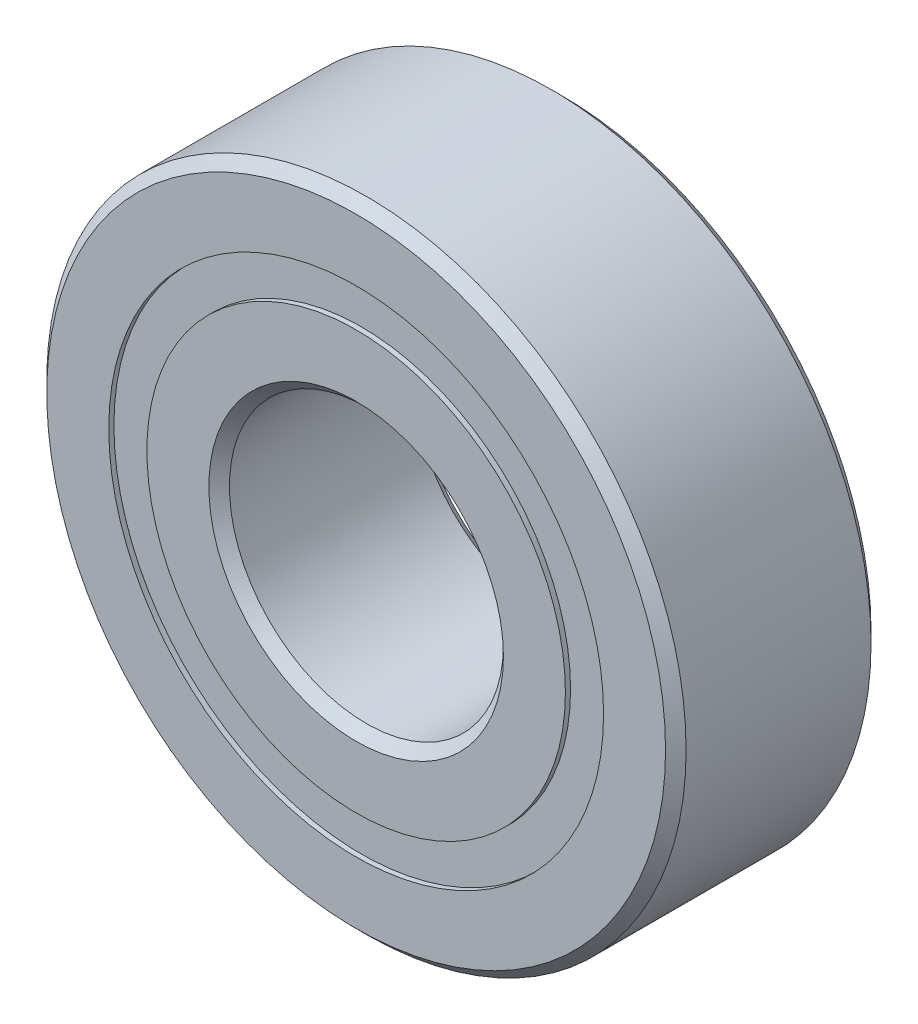
ISO-10303-21;
HEADER;
FILE_DESCRIPTION(('STEP AP214'),'2;1');
FILE_NAME('part.step','',(''),(''),'','','');
FILE_SCHEMA(('AUTOMOTIVE_DESIGN { 1 0 10303 214 1 1 1 1 }'));
ENDSEC;
DATA;
#1=APPLICATION_CONTEXT('core data for automotive mechanical design processes');
#2=APPLICATION_PROTOCOL_DEFINITION('international standard','automotive_design',2000,#1);
#3=PRODUCT_CONTEXT('',#1,'mechanical');
#4=PRODUCT('Part','Part','',(#3));
#5=PRODUCT_RELATED_PRODUCT_CATEGORY('part','',(#4));
#6=PRODUCT_DEFINITION_FORMATION('','',#4);
#7=PRODUCT_DEFINITION_CONTEXT('part definition',#1,'design');
#8=PRODUCT_DEFINITION('design','',#6,#7);
#9=PRODUCT_DEFINITION_SHAPE('','',#8);
#10=(LENGTH_UNIT() NAMED_UNIT(*) SI_UNIT(.MILLI.,.METRE.));
#11=(NAMED_UNIT(*) PLANE_ANGLE_UNIT() SI_UNIT($,.RADIAN.));
#12=(NAMED_UNIT(*) SI_UNIT($,.STERADIAN.) SOLID_ANGLE_UNIT());
#13=UNCERTAINTY_MEASURE_WITH_UNIT(LENGTH_MEASURE(1.E-05),#10,'distance_accuracy_value','');
#14=(GEOMETRIC_REPRESENTATION_CONTEXT(3) GLOBAL_UNCERTAINTY_ASSIGNED_CONTEXT((#13)) GLOBAL_UNIT_ASSIGNED_CONTEXT((#10,
#11,#12)) REPRESENTATION_CONTEXT('',''));
#15=CARTESIAN_POINT('',(0.,0.,0.));
#16=DIRECTION('',(0.,0.,1.));
#17=DIRECTION('',(1.,0.,0.));
#18=AXIS2_PLACEMENT_3D('',#15,#16,#17);
#19=CARTESIAN_POINT('',(0.,8.60041208791209,-3.39328125));
#20=DIRECTION('',(0.,0.,1.));
#21=DIRECTION('',(1.,0.,0.));
#22=AXIS2_PLACEMENT_3D('',#19,#20,#21);
#23=PLANE('',#22);
#24=CARTESIAN_POINT('',(0.,0.,-3.39328125));
#25=DIRECTION('',(0.,0.,1.));
#26=DIRECTION('',(1.,0.,0.));
#27=AXIS2_PLACEMENT_3D('',#24,#25,#26);
#28=CIRCLE('',#27,8.60041208791209);
#29=CARTESIAN_POINT('',(8.60041208791209,0.,-3.39328125));
#30=VERTEX_POINT('',#29);
#31=EDGE_CURVE('E55',#30,#30,#28,.T.);
#32=ORIENTED_EDGE('',*,*,#31,.F.);
#33=EDGE_LOOP('',(#32));
#34=FACE_BOUND('',#33,.T.);
#35=CARTESIAN_POINT('',(0.,0.,-3.39328125));
#36=DIRECTION('',(0.,0.,1.));
#37=DIRECTION('',(1.,0.,0.));
#38=AXIS2_PLACEMENT_3D('',#35,#36,#37);
#39=CIRCLE('',#38,7.27458791208791);
#40=CARTESIAN_POINT('',(7.27458791208791,0.,-3.39328125));
#41=VERTEX_POINT('',#40);
#42=EDGE_CURVE('E11',#41,#41,#39,.T.);
#43=ORIENTED_EDGE('',*,*,#42,.T.);
#44=EDGE_LOOP('',(#43));
#45=FACE_BOUND('',#44,.T.);
#46=ADVANCED_FACE('F41',(#34,#45),#23,.F.);
#47=CARTESIAN_POINT('',(0.,0.,3.571875));
#48=DIRECTION('',(0.,0.,1.));
#49=DIRECTION('',(1.,0.,0.));
#50=AXIS2_PLACEMENT_3D('',#47,#48,#49);
#51=CYLINDRICAL_SURFACE('',#50,7.27458791208791);
#52=ORIENTED_EDGE('',*,*,#42,.F.);
#53=EDGE_LOOP('',(#52));
#54=FACE_BOUND('',#53,.T.);
#55=CARTESIAN_POINT('',(0.,0.,-1.72035132641562));
#56=DIRECTION('',(0.,0.,1.));
#57=DIRECTION('',(1.,0.,0.));
#58=AXIS2_PLACEMENT_3D('',#55,#56,#57);
#59=CIRCLE('',#58,7.27458791208791);
#60=CARTESIAN_POINT('',(7.27458791208791,0.,-1.72035132641562));
#61=VERTEX_POINT('',#60);
#62=EDGE_CURVE('E47',#61,#61,#59,.T.);
#63=ORIENTED_EDGE('',*,*,#62,.T.);
#64=EDGE_LOOP('',(#63));
#65=FACE_BOUND('',#64,.T.);
#66=ADVANCED_FACE('F64',(#54,#65),#51,.F.);
#67=CARTESIAN_POINT('',(0.,8.60041208791209,-1.72035132641562));
#68=DIRECTION('',(0.,0.,-1.));
#69=DIRECTION('',(-1.,0.,0.));
#70=AXIS2_PLACEMENT_3D('',#67,#68,#69);
#71=PLANE('',#70);
#72=ORIENTED_EDGE('',*,*,#62,.F.);
#73=EDGE_LOOP('',(#72));
#74=FACE_BOUND('',#73,.T.);
#75=CARTESIAN_POINT('',(0.,0.,-1.72035132641562));
#76=DIRECTION('',(0.,0.,1.));
#77=DIRECTION('',(1.,0.,0.));
#78=AXIS2_PLACEMENT_3D('',#75,#76,#77);
#79=CIRCLE('',#78,8.60041208791209);
#80=CARTESIAN_POINT('',(8.60041208791209,0.,-1.72035132641562));
#81=VERTEX_POINT('',#80);
#82=EDGE_CURVE('E51',#81,#81,#79,.T.);
#83=ORIENTED_EDGE('',*,*,#82,.T.);
#84=EDGE_LOOP('',(#83));
#85=FACE_BOUND('',#84,.T.);
#86=ADVANCED_FACE('F68',(#74,#85),#71,.F.);
#87=CARTESIAN_POINT('',(0.,0.,3.571875));
#88=DIRECTION('',(0.,0.,1.));
#89=DIRECTION('',(1.,0.,0.));
#90=AXIS2_PLACEMENT_3D('',#87,#88,#89);
#91=CYLINDRICAL_SURFACE('',#90,8.60041208791209);
#92=ORIENTED_EDGE('',*,*,#82,.F.);
#93=EDGE_LOOP('',(#92));
#94=FACE_BOUND('',#93,.T.);
#95=ORIENTED_EDGE('',*,*,#31,.T.);
#96=EDGE_LOOP('',(#95));
#97=FACE_BOUND('',#96,.T.);
#98=ADVANCED_FACE('F61',(#94,#97),#91,.T.);
#99=CLOSED_SHELL('',(#46,#66,#86,#98));
#100=MANIFOLD_SOLID_BREP('B2',#99);
#101=CARTESIAN_POINT('',(0.,8.60041208791209,3.39328125));
#102=DIRECTION('',(0.,0.,-1.));
#103=DIRECTION('',(-1.,0.,0.));
#104=AXIS2_PLACEMENT_3D('',#101,#102,#103);
#105=PLANE('',#104);
#106=CARTESIAN_POINT('',(0.,0.,3.39328125));
#107=DIRECTION('',(0.,0.,1.));
#108=DIRECTION('',(1.,0.,0.));
#109=AXIS2_PLACEMENT_3D('',#106,#107,#108);
#110=CIRCLE('',#109,7.27458791208791);
#111=CARTESIAN_POINT('',(7.27458791208791,0.,3.39328125));
#112=VERTEX_POINT('',#111);
#113=EDGE_CURVE('E40',#112,#112,#110,.T.);
#114=ORIENTED_EDGE('',*,*,#113,.F.);
#115=EDGE_LOOP('',(#114));
#116=FACE_BOUND('',#115,.T.);
#117=CARTESIAN_POINT('',(0.,0.,3.39328125));
#118=DIRECTION('',(0.,0.,1.));
#119=DIRECTION('',(1.,0.,0.));
#120=AXIS2_PLACEMENT_3D('',#117,#118,#119);
#121=CIRCLE('',#120,8.60041208791209);
#122=CARTESIAN_POINT('',(8.60041208791209,0.,3.39328125));
#123=VERTEX_POINT('',#122);
#124=EDGE_CURVE('E122',#123,#123,#121,.T.);
#125=ORIENTED_EDGE('',*,*,#124,.T.);
#126=EDGE_LOOP('',(#125));
#127=FACE_BOUND('',#126,.T.);
#128=ADVANCED_FACE('F108',(#116,#127),#105,.F.);
#129=CARTESIAN_POINT('',(0.,0.,3.571875));
#130=DIRECTION('',(0.,0.,1.));
#131=DIRECTION('',(1.,0.,0.));
#132=AXIS2_PLACEMENT_3D('',#129,#130,#131);
#133=CYLINDRICAL_SURFACE('',#132,7.27458791208791);
#134=CARTESIAN_POINT('',(0.,0.,1.72035132641561));
#135=DIRECTION('',(0.,0.,1.));
#136=DIRECTION('',(1.,0.,0.));
#137=AXIS2_PLACEMENT_3D('',#134,#135,#136);
#138=CIRCLE('',#137,7.27458791208791);
#139=CARTESIAN_POINT('',(7.27458791208791,0.,1.72035132641561));
#140=VERTEX_POINT('',#139);
#141=EDGE_CURVE('E114',#140,#140,#138,.T.);
#142=ORIENTED_EDGE('',*,*,#141,.F.);
#143=EDGE_LOOP('',(#142));
#144=FACE_BOUND('',#143,.T.);
#145=ORIENTED_EDGE('',*,*,#113,.T.);
#146=EDGE_LOOP('',(#145));
#147=FACE_BOUND('',#146,.T.);
#148=ADVANCED_FACE('F137',(#144,#147),#133,.F.);
#149=CARTESIAN_POINT('',(0.,8.60041208791209,1.72035132641561));
#150=DIRECTION('',(0.,0.,1.));
#151=DIRECTION('',(1.,0.,0.));
#152=AXIS2_PLACEMENT_3D('',#149,#150,#151);
#153=PLANE('',#152);
#154=CARTESIAN_POINT('',(0.,0.,1.72035132641561));
#155=DIRECTION('',(0.,0.,1.));
#156=DIRECTION('',(1.,0.,0.));
#157=AXIS2_PLACEMENT_3D('',#154,#155,#156);
#158=CIRCLE('',#157,8.60041208791209);
#159=CARTESIAN_POINT('',(8.60041208791209,0.,1.72035132641561));
#160=VERTEX_POINT('',#159);
#161=EDGE_CURVE('E118',#160,#160,#158,.T.);
#162=ORIENTED_EDGE('',*,*,#161,.F.);
#163=EDGE_LOOP('',(#162));
#164=FACE_BOUND('',#163,.T.);
#165=ORIENTED_EDGE('',*,*,#141,.T.);
#166=EDGE_LOOP('',(#165));
#167=FACE_BOUND('',#166,.T.);
#168=ADVANCED_FACE('F132',(#164,#167),#153,.F.);
#169=CARTESIAN_POINT('',(0.,0.,3.571875));
#170=DIRECTION('',(0.,0.,1.));
#171=DIRECTION('',(1.,0.,0.));
#172=AXIS2_PLACEMENT_3D('',#169,#170,#171);
#173=CYLINDRICAL_SURFACE('',#172,8.60041208791209);
#174=ORIENTED_EDGE('',*,*,#124,.F.);
#175=EDGE_LOOP('',(#174));
#176=FACE_BOUND('',#175,.T.);
#177=ORIENTED_EDGE('',*,*,#161,.T.);
#178=EDGE_LOOP('',(#177));
#179=FACE_BOUND('',#178,.T.);
#180=ADVANCED_FACE('F129',(#176,#179),#173,.T.);
#181=CLOSED_SHELL('',(#128,#148,#168,#180));
#182=MANIFOLD_SOLID_BREP('B6',#181);
#183=CARTESIAN_POINT('',(-4.66554544007142,6.42157239285121,0.));
#184=DIRECTION('',(0.,0.,1.));
#185=DIRECTION('',(-0.587785252292462,0.809016994374955,0.));
#186=AXIS2_PLACEMENT_3D('',#183,#184,#185);
#187=SPHERICAL_SURFACE('',#186,1.72035132641561);
#188=CARTESIAN_POINT('',(-4.66554544007142,6.42157239285121,1.72035132641561));
#189=VERTEX_POINT('',#188);
#190=VERTEX_LOOP('',#189);
#191=FACE_BOUND('',#190,.T.);
#192=ADVANCED_FACE('F175',(#191),#187,.T.);
#193=CLOSED_SHELL('',(#192));
#194=MANIFOLD_SOLID_BREP('B35',#193);
#195=CARTESIAN_POINT('',(-7.54901109809275,2.45282239285123,0.));
#196=DIRECTION('',(0.,0.,1.));
#197=DIRECTION('',(-0.95105651629515,0.309016994374958,0.));
#198=AXIS2_PLACEMENT_3D('',#195,#196,#197);
#199=SPHERICAL_SURFACE('',#198,1.72035132641561);
#200=CARTESIAN_POINT('',(-7.54901109809275,2.45282239285123,1.72035132641561));
#201=VERTEX_POINT('',#200);
#202=VERTEX_LOOP('',#201);
#203=FACE_BOUND('',#202,.T.);
#204=ADVANCED_FACE('F195',(#203),#199,.T.);
#205=CLOSED_SHELL('',(#204));
#206=MANIFOLD_SOLID_BREP('B104',#205);
#207=CARTESIAN_POINT('',(-7.54901109809281,-2.45282239285107,0.));
#208=DIRECTION('',(0.,0.,1.));
#209=DIRECTION('',(-0.951056516295157,-0.309016994374938,0.));
#210=AXIS2_PLACEMENT_3D('',#207,#208,#209);
#211=SPHERICAL_SURFACE('',#210,1.72035132641561);
#212=CARTESIAN_POINT('',(-7.54901109809281,-2.45282239285107,1.72035132641561));
#213=VERTEX_POINT('',#212);
#214=VERTEX_LOOP('',#213);
#215=FACE_BOUND('',#214,.T.);
#216=ADVANCED_FACE('F215',(#215),#211,.T.);
#217=CLOSED_SHELL('',(#216));
#218=MANIFOLD_SOLID_BREP('B171',#217);
#219=CARTESIAN_POINT('',(-4.66554544007156,-6.4215723928511,0.));
#220=DIRECTION('',(0.,0.,1.));
#221=DIRECTION('',(-0.58778525229248,-0.809016994374942,0.));
#222=AXIS2_PLACEMENT_3D('',#219,#220,#221);
#223=SPHERICAL_SURFACE('',#222,1.72035132641561);
#224=CARTESIAN_POINT('',(-4.66554544007156,-6.4215723928511,1.72035132641561));
#225=VERTEX_POINT('',#224);
#226=VERTEX_LOOP('',#225);
#227=FACE_BOUND('',#226,.T.);
#228=ADVANCED_FACE('F235',(#227),#223,.T.);
#229=CLOSED_SHELL('',(#228));
#230=MANIFOLD_SOLID_BREP('B191',#229);
#231=CARTESIAN_POINT('',(0.,-7.9375,0.));
#232=DIRECTION('',(0.,0.,1.));
#233=DIRECTION('',(0.,-1.,0.));
#234=AXIS2_PLACEMENT_3D('',#231,#232,#233);
#235=SPHERICAL_SURFACE('',#234,1.72035132641561);
#236=CARTESIAN_POINT('',(0.,-7.9375,1.72035132641561));
#237=VERTEX_POINT('',#236);
#238=VERTEX_LOOP('',#237);
#239=FACE_BOUND('',#238,.T.);
#240=ADVANCED_FACE('F255',(#239),#235,.T.);
#241=CLOSED_SHELL('',(#240));
#242=MANIFOLD_SOLID_BREP('B211',#241);
#243=CARTESIAN_POINT('',(4.66554544007147,-6.42157239285117,0.));
#244=DIRECTION('',(0.,0.,1.));
#245=DIRECTION('',(0.587785252292469,-0.809016994374951,0.));
#246=AXIS2_PLACEMENT_3D('',#243,#244,#245);
#247=SPHERICAL_SURFACE('',#246,1.72035132641561);
#248=CARTESIAN_POINT('',(4.66554544007147,-6.42157239285117,1.72035132641561));
#249=VERTEX_POINT('',#248);
#250=VERTEX_LOOP('',#249);
#251=FACE_BOUND('',#250,.T.);
#252=ADVANCED_FACE('F275',(#251),#247,.T.);
#253=CLOSED_SHELL('',(#252));
#254=MANIFOLD_SOLID_BREP('B231',#253);
#255=CARTESIAN_POINT('',(7.54901109809277,-2.45282239285118,0.));
#256=DIRECTION('',(0.,0.,1.));
#257=DIRECTION('',(0.951056516295152,-0.309016994374952,0.));
#258=AXIS2_PLACEMENT_3D('',#255,#256,#257);
#259=SPHERICAL_SURFACE('',#258,1.72035132641561);
#260=CARTESIAN_POINT('',(7.54901109809277,-2.45282239285118,1.72035132641561));
#261=VERTEX_POINT('',#260);
#262=VERTEX_LOOP('',#261);
#263=FACE_BOUND('',#262,.T.);
#264=ADVANCED_FACE('F295',(#263),#259,.T.);
#265=CLOSED_SHELL('',(#264));
#266=MANIFOLD_SOLID_BREP('B251',#265);
#267=CARTESIAN_POINT('',(7.54901109809279,2.45282239285112,0.));
#268=DIRECTION('',(0.,0.,1.));
#269=DIRECTION('',(0.951056516295155,0.309016994374945,0.));
#270=AXIS2_PLACEMENT_3D('',#267,#268,#269);
#271=SPHERICAL_SURFACE('',#270,1.72035132641561);
#272=CARTESIAN_POINT('',(7.54901109809279,2.45282239285112,1.72035132641561));
#273=VERTEX_POINT('',#272);
#274=VERTEX_LOOP('',#273);
#275=FACE_BOUND('',#274,.T.);
#276=ADVANCED_FACE('F315',(#275),#271,.T.);
#277=CLOSED_SHELL('',(#276));
#278=MANIFOLD_SOLID_BREP('B271',#277);
#279=CARTESIAN_POINT('',(4.66554544007152,6.42157239285114,0.));
#280=DIRECTION('',(0.,0.,1.));
#281=DIRECTION('',(0.587785252292474,0.809016994374947,0.));
#282=AXIS2_PLACEMENT_3D('',#279,#280,#281);
#283=SPHERICAL_SURFACE('',#282,1.72035132641561);
#284=CARTESIAN_POINT('',(4.66554544007152,6.42157239285114,1.72035132641561));
#285=VERTEX_POINT('',#284);
#286=VERTEX_LOOP('',#285);
#287=FACE_BOUND('',#286,.T.);
#288=ADVANCED_FACE('F335',(#287),#283,.T.);
#289=CLOSED_SHELL('',(#288));
#290=MANIFOLD_SOLID_BREP('B291',#289);
#291=CARTESIAN_POINT('',(0.,7.9375,0.));
#292=DIRECTION('',(0.,0.,1.));
#293=DIRECTION('',(0.,1.,0.));
#294=AXIS2_PLACEMENT_3D('',#291,#292,#293);
#295=SPHERICAL_SURFACE('',#294,1.72035132641561);
#296=CARTESIAN_POINT('',(0.,7.9375,1.72035132641561));
#297=VERTEX_POINT('',#296);
#298=VERTEX_LOOP('',#297);
#299=FACE_BOUND('',#298,.T.);
#300=ADVANCED_FACE('F357',(#299),#295,.T.);
#301=CLOSED_SHELL('',(#300));
#302=MANIFOLD_SOLID_BREP('B311',#301);
#303=CARTESIAN_POINT('',(0.,7.27458791208791,3.571875));
#304=DIRECTION('',(0.,0.,-1.));
#305=DIRECTION('',(-1.,0.,0.));
#306=AXIS2_PLACEMENT_3D('',#303,#304,#305);
#307=PLANE('',#306);
#308=CARTESIAN_POINT('',(0.,0.,3.571875));
#309=DIRECTION('',(0.,0.,1.));
#310=DIRECTION('',(1.,0.,0.));
#311=AXIS2_PLACEMENT_3D('',#308,#309,#310);
#312=CIRCLE('',#311,5.1196875);
#313=CARTESIAN_POINT('',(5.1196875,0.,3.571875));
#314=VERTEX_POINT('',#313);
#315=EDGE_CURVE('E404',#314,#314,#312,.T.);
#316=ORIENTED_EDGE('',*,*,#315,.F.);
#317=EDGE_LOOP('',(#316));
#318=FACE_BOUND('',#317,.T.);
#319=CARTESIAN_POINT('',(0.,0.,3.571875));
#320=DIRECTION('',(0.,0.,1.));
#321=DIRECTION('',(1.,0.,0.));
#322=AXIS2_PLACEMENT_3D('',#319,#320,#321);
#323=CIRCLE('',#322,7.27458791208791);
#324=CARTESIAN_POINT('',(7.27458791208791,0.,3.571875));
#325=VERTEX_POINT('',#324);
#326=EDGE_CURVE('E356',#325,#325,#323,.T.);
#327=ORIENTED_EDGE('',*,*,#326,.T.);
#328=EDGE_LOOP('',(#327));
#329=FACE_BOUND('',#328,.T.);
#330=ADVANCED_FACE('F376',(#318,#329),#307,.F.);
#331=CARTESIAN_POINT('',(0.,0.,3.571875));
#332=DIRECTION('',(0.,0.,1.));
#333=DIRECTION('',(1.,0.,0.));
#334=AXIS2_PLACEMENT_3D('',#331,#332,#333);
#335=CYLINDRICAL_SURFACE('',#334,7.27458791208791);
#336=ORIENTED_EDGE('',*,*,#326,.F.);
#337=EDGE_LOOP('',(#336));
#338=FACE_BOUND('',#337,.T.);
#339=CARTESIAN_POINT('',(0.,0.,1.5875));
#340=DIRECTION('',(0.,0.,1.));
#341=DIRECTION('',(1.,0.,0.));
#342=AXIS2_PLACEMENT_3D('',#339,#340,#341);
#343=CIRCLE('',#342,7.27458791208791);
#344=CARTESIAN_POINT('',(7.27458791208791,0.,1.5875));
#345=VERTEX_POINT('',#344);
#346=EDGE_CURVE('E382',#345,#345,#343,.T.);
#347=ORIENTED_EDGE('',*,*,#346,.T.);
#348=EDGE_LOOP('',(#347));
#349=FACE_BOUND('',#348,.T.);
#350=ADVANCED_FACE('F411',(#338,#349),#335,.T.);
#351=CARTESIAN_POINT('',(0.,0.,0.));
#352=DIRECTION('',(0.,0.,1.));
#353=DIRECTION('',(1.,0.,0.));
#354=AXIS2_PLACEMENT_3D('',#351,#352,#353);
#355=TOROIDAL_SURFACE('',#354,7.93749999999999,1.72035132641561);
#356=ORIENTED_EDGE('',*,*,#346,.F.);
#357=EDGE_LOOP('',(#356));
#358=FACE_BOUND('',#357,.T.);
#359=CARTESIAN_POINT('',(0.,0.,-1.5875));
#360=DIRECTION('',(0.,0.,1.));
#361=DIRECTION('',(1.,0.,0.));
#362=AXIS2_PLACEMENT_3D('',#359,#360,#361);
#363=CIRCLE('',#362,7.27458791208791);
#364=CARTESIAN_POINT('',(7.27458791208791,0.,-1.5875));
#365=VERTEX_POINT('',#364);
#366=EDGE_CURVE('E386',#365,#365,#363,.T.);
#367=ORIENTED_EDGE('',*,*,#366,.T.);
#368=EDGE_LOOP('',(#367));
#369=FACE_BOUND('',#368,.T.);
#370=ADVANCED_FACE('F415',(#358,#369),#355,.F.);
#371=CARTESIAN_POINT('',(0.,0.,3.571875));
#372=DIRECTION('',(0.,0.,1.));
#373=DIRECTION('',(1.,0.,0.));
#374=AXIS2_PLACEMENT_3D('',#371,#372,#373);
#375=CYLINDRICAL_SURFACE('',#374,7.27458791208791);
#376=ORIENTED_EDGE('',*,*,#366,.F.);
#377=EDGE_LOOP('',(#376));
#378=FACE_BOUND('',#377,.T.);
#379=CARTESIAN_POINT('',(0.,0.,-3.571875));
#380=DIRECTION('',(0.,0.,1.));
#381=DIRECTION('',(1.,0.,0.));
#382=AXIS2_PLACEMENT_3D('',#379,#380,#381);
#383=CIRCLE('',#382,7.27458791208791);
#384=CARTESIAN_POINT('',(7.27458791208791,0.,-3.571875));
#385=VERTEX_POINT('',#384);
#386=EDGE_CURVE('E390',#385,#385,#383,.T.);
#387=ORIENTED_EDGE('',*,*,#386,.T.);
#388=EDGE_LOOP('',(#387));
#389=FACE_BOUND('',#388,.T.);
#390=ADVANCED_FACE('F420',(#378,#389),#375,.T.);
#391=CARTESIAN_POINT('',(0.,5.1196875,-3.571875));
#392=DIRECTION('',(0.,0.,1.));
#393=DIRECTION('',(1.,0.,0.));
#394=AXIS2_PLACEMENT_3D('',#391,#392,#393);
#395=PLANE('',#394);
#396=ORIENTED_EDGE('',*,*,#386,.F.);
#397=EDGE_LOOP('',(#396));
#398=FACE_BOUND('',#397,.T.);
#399=CARTESIAN_POINT('',(0.,0.,-3.571875));
#400=DIRECTION('',(0.,0.,1.));
#401=DIRECTION('',(1.,0.,0.));
#402=AXIS2_PLACEMENT_3D('',#399,#400,#401);
#403=CIRCLE('',#402,5.1196875);
#404=CARTESIAN_POINT('',(5.1196875,0.,-3.571875));
#405=VERTEX_POINT('',#404);
#406=EDGE_CURVE('E395',#405,#405,#403,.T.);
#407=ORIENTED_EDGE('',*,*,#406,.T.);
#408=EDGE_LOOP('',(#407));
#409=FACE_BOUND('',#408,.T.);
#410=ADVANCED_FACE('F426',(#398,#409),#395,.F.);
#411=CARTESIAN_POINT('',(0.,0.,-3.2146875));
#412=DIRECTION('',(0.,0.,-1.));
#413=DIRECTION('',(-1.,0.,0.));
#414=AXIS2_PLACEMENT_3D('',#411,#412,#413);
#415=CONICAL_SURFACE('',#414,4.7625,0.785398163397444);
#416=ORIENTED_EDGE('',*,*,#406,.F.);
#417=EDGE_LOOP('',(#416));
#418=FACE_BOUND('',#417,.T.);
#419=CARTESIAN_POINT('',(0.,0.,-3.2146875));
#420=DIRECTION('',(0.,0.,1.));
#421=DIRECTION('',(1.,0.,0.));
#422=AXIS2_PLACEMENT_3D('',#419,#420,#421);
#423=CIRCLE('',#422,4.7625);
#424=CARTESIAN_POINT('',(4.7625,0.,-3.2146875));
#425=VERTEX_POINT('',#424);
#426=EDGE_CURVE('E398',#425,#425,#423,.T.);
#427=ORIENTED_EDGE('',*,*,#426,.T.);
#428=EDGE_LOOP('',(#427));
#429=FACE_BOUND('',#428,.T.);
#430=ADVANCED_FACE('F430',(#418,#429),#415,.F.);
#431=CARTESIAN_POINT('',(0.,0.,3.571875));
#432=DIRECTION('',(0.,0.,1.));
#433=DIRECTION('',(1.,0.,0.));
#434=AXIS2_PLACEMENT_3D('',#431,#432,#433);
#435=CYLINDRICAL_SURFACE('',#434,4.7625);
#436=ORIENTED_EDGE('',*,*,#426,.F.);
#437=EDGE_LOOP('',(#436));
#438=FACE_BOUND('',#437,.T.);
#439=CARTESIAN_POINT('',(0.,0.,3.2146875));
#440=DIRECTION('',(0.,0.,1.));
#441=DIRECTION('',(1.,0.,0.));
#442=AXIS2_PLACEMENT_3D('',#439,#440,#441);
#443=CIRCLE('',#442,4.7625);
#444=CARTESIAN_POINT('',(4.7625,0.,3.2146875));
#445=VERTEX_POINT('',#444);
#446=EDGE_CURVE('E401',#445,#445,#443,.T.);
#447=ORIENTED_EDGE('',*,*,#446,.T.);
#448=EDGE_LOOP('',(#447));
#449=FACE_BOUND('',#448,.T.);
#450=ADVANCED_FACE('F434',(#438,#449),#435,.F.);
#451=CARTESIAN_POINT('',(0.,0.,3.571875));
#452=DIRECTION('',(0.,0.,1.));
#453=DIRECTION('',(1.,0.,0.));
#454=AXIS2_PLACEMENT_3D('',#451,#452,#453);
#455=CONICAL_SURFACE('',#454,5.1196875,0.785398163397453);
#456=ORIENTED_EDGE('',*,*,#446,.F.);
#457=EDGE_LOOP('',(#456));
#458=FACE_BOUND('',#457,.T.);
#459=ORIENTED_EDGE('',*,*,#315,.T.);
#460=EDGE_LOOP('',(#459));
#461=FACE_BOUND('',#460,.T.);
#462=ADVANCED_FACE('F408',(#458,#461),#455,.F.);
#463=CLOSED_SHELL('',(#330,#350,#370,#390,#410,#430,#450,#462));
#464=MANIFOLD_SOLID_BREP('B331',#463);
#465=CARTESIAN_POINT('',(0.,0.,3.2146875));
#466=DIRECTION('',(0.,0.,-1.));
#467=DIRECTION('',(-1.,0.,0.));
#468=AXIS2_PLACEMENT_3D('',#465,#466,#467);
#469=CONICAL_SURFACE('',#468,11.1125,0.785398163397446);
#470=CARTESIAN_POINT('',(0.,0.,3.571875));
#471=DIRECTION('',(0.,0.,1.));
#472=DIRECTION('',(1.,0.,0.));
#473=AXIS2_PLACEMENT_3D('',#470,#471,#472);
#474=CIRCLE('',#473,10.7553125);
#475=CARTESIAN_POINT('',(10.7553125,0.,3.571875));
#476=VERTEX_POINT('',#475);
#477=EDGE_CURVE('E525',#476,#476,#474,.T.);
#478=ORIENTED_EDGE('',*,*,#477,.F.);
#479=EDGE_LOOP('',(#478));
#480=FACE_BOUND('',#479,.T.);
#481=CARTESIAN_POINT('',(0.,0.,3.2146875));
#482=DIRECTION('',(0.,0.,1.));
#483=DIRECTION('',(1.,0.,0.));
#484=AXIS2_PLACEMENT_3D('',#481,#482,#483);
#485=CIRCLE('',#484,11.1125);
#486=CARTESIAN_POINT('',(11.1125,0.,3.2146875));
#487=VERTEX_POINT('',#486);
#488=EDGE_CURVE('E375',#487,#487,#485,.T.);
#489=ORIENTED_EDGE('',*,*,#488,.T.);
#490=EDGE_LOOP('',(#489));
#491=FACE_BOUND('',#490,.T.);
#492=ADVANCED_FACE('F497',(#480,#491),#469,.T.);
#493=CARTESIAN_POINT('',(0.,0.,3.571875));
#494=DIRECTION('',(0.,0.,1.));
#495=DIRECTION('',(1.,0.,0.));
#496=AXIS2_PLACEMENT_3D('',#493,#494,#495);
#497=CYLINDRICAL_SURFACE('',#496,11.1125);
#498=ORIENTED_EDGE('',*,*,#488,.F.);
#499=EDGE_LOOP('',(#498));
#500=FACE_BOUND('',#499,.T.);
#501=CARTESIAN_POINT('',(0.,0.,-3.2146875));
#502=DIRECTION('',(0.,0.,1.));
#503=DIRECTION('',(1.,0.,0.));
#504=AXIS2_PLACEMENT_3D('',#501,#502,#503);
#505=CIRCLE('',#504,11.1125);
#506=CARTESIAN_POINT('',(11.1125,0.,-3.2146875));
#507=VERTEX_POINT('',#506);
#508=EDGE_CURVE('E503',#507,#507,#505,.T.);
#509=ORIENTED_EDGE('',*,*,#508,.T.);
#510=EDGE_LOOP('',(#509));
#511=FACE_BOUND('',#510,.T.);
#512=ADVANCED_FACE('F532',(#500,#511),#497,.T.);
#513=CARTESIAN_POINT('',(0.,0.,-3.571875));
#514=DIRECTION('',(0.,0.,1.));
#515=DIRECTION('',(1.,0.,0.));
#516=AXIS2_PLACEMENT_3D('',#513,#514,#515);
#517=CONICAL_SURFACE('',#516,10.7553125,0.785398163397444);
#518=ORIENTED_EDGE('',*,*,#508,.F.);
#519=EDGE_LOOP('',(#518));
#520=FACE_BOUND('',#519,.T.);
#521=CARTESIAN_POINT('',(0.,0.,-3.571875));
#522=DIRECTION('',(0.,0.,1.));
#523=DIRECTION('',(1.,0.,0.));
#524=AXIS2_PLACEMENT_3D('',#521,#522,#523);
#525=CIRCLE('',#524,10.7553125);
#526=CARTESIAN_POINT('',(10.7553125,0.,-3.571875));
#527=VERTEX_POINT('',#526);
#528=EDGE_CURVE('E507',#527,#527,#525,.T.);
#529=ORIENTED_EDGE('',*,*,#528,.T.);
#530=EDGE_LOOP('',(#529));
#531=FACE_BOUND('',#530,.T.);
#532=ADVANCED_FACE('F536',(#520,#531),#517,.T.);
#533=CARTESIAN_POINT('',(0.,10.7553125,-3.571875));
#534=DIRECTION('',(0.,0.,1.));
#535=DIRECTION('',(1.,0.,0.));
#536=AXIS2_PLACEMENT_3D('',#533,#534,#535);
#537=PLANE('',#536);
#538=ORIENTED_EDGE('',*,*,#528,.F.);
#539=EDGE_LOOP('',(#538));
#540=FACE_BOUND('',#539,.T.);
#541=CARTESIAN_POINT('',(0.,0.,-3.571875));
#542=DIRECTION('',(0.,0.,1.));
#543=DIRECTION('',(1.,0.,0.));
#544=AXIS2_PLACEMENT_3D('',#541,#542,#543);
#545=CIRCLE('',#544,8.60041208791209);
#546=CARTESIAN_POINT('',(8.60041208791209,0.,-3.571875));
#547=VERTEX_POINT('',#546);
#548=EDGE_CURVE('E511',#547,#547,#545,.T.);
#549=ORIENTED_EDGE('',*,*,#548,.T.);
#550=EDGE_LOOP('',(#549));
#551=FACE_BOUND('',#550,.T.);
#552=ADVANCED_FACE('F541',(#540,#551),#537,.F.);
#553=CARTESIAN_POINT('',(0.,0.,3.571875));
#554=DIRECTION('',(0.,0.,1.));
#555=DIRECTION('',(1.,0.,0.));
#556=AXIS2_PLACEMENT_3D('',#553,#554,#555);
#557=CYLINDRICAL_SURFACE('',#556,8.60041208791209);
#558=ORIENTED_EDGE('',*,*,#548,.F.);
#559=EDGE_LOOP('',(#558));
#560=FACE_BOUND('',#559,.T.);
#561=CARTESIAN_POINT('',(0.,0.,-1.5875));
#562=DIRECTION('',(0.,0.,1.));
#563=DIRECTION('',(1.,0.,0.));
#564=AXIS2_PLACEMENT_3D('',#561,#562,#563);
#565=CIRCLE('',#564,8.60041208791209);
#566=CARTESIAN_POINT('',(8.60041208791209,0.,-1.5875));
#567=VERTEX_POINT('',#566);
#568=EDGE_CURVE('E516',#567,#567,#565,.T.);
#569=ORIENTED_EDGE('',*,*,#568,.T.);
#570=EDGE_LOOP('',(#569));
#571=FACE_BOUND('',#570,.T.);
#572=ADVANCED_FACE('F547',(#560,#571),#557,.F.);
#573=CARTESIAN_POINT('',(0.,0.,0.));
#574=DIRECTION('',(0.,0.,1.));
#575=DIRECTION('',(1.,0.,0.));
#576=AXIS2_PLACEMENT_3D('',#573,#574,#575);
#577=TOROIDAL_SURFACE('',#576,7.9375,1.72035132641561);
#578=ORIENTED_EDGE('',*,*,#568,.F.);
#579=EDGE_LOOP('',(#578));
#580=FACE_BOUND('',#579,.T.);
#581=CARTESIAN_POINT('',(0.,0.,1.5875));
#582=DIRECTION('',(0.,0.,1.));
#583=DIRECTION('',(1.,0.,0.));
#584=AXIS2_PLACEMENT_3D('',#581,#582,#583);
#585=CIRCLE('',#584,8.60041208791209);
#586=CARTESIAN_POINT('',(8.60041208791209,0.,1.5875));
#587=VERTEX_POINT('',#586);
#588=EDGE_CURVE('E519',#587,#587,#585,.T.);
#589=ORIENTED_EDGE('',*,*,#588,.T.);
#590=EDGE_LOOP('',(#589));
#591=FACE_BOUND('',#590,.T.);
#592=ADVANCED_FACE('F551',(#580,#591),#577,.F.);
#593=CARTESIAN_POINT('',(0.,0.,3.571875));
#594=DIRECTION('',(0.,0.,1.));
#595=DIRECTION('',(1.,0.,0.));
#596=AXIS2_PLACEMENT_3D('',#593,#594,#595);
#597=CYLINDRICAL_SURFACE('',#596,8.60041208791209);
#598=ORIENTED_EDGE('',*,*,#588,.F.);
#599=EDGE_LOOP('',(#598));
#600=FACE_BOUND('',#599,.T.);
#601=CARTESIAN_POINT('',(0.,0.,3.571875));
#602=DIRECTION('',(0.,0.,1.));
#603=DIRECTION('',(1.,0.,0.));
#604=AXIS2_PLACEMENT_3D('',#601,#602,#603);
#605=CIRCLE('',#604,8.60041208791209);
#606=CARTESIAN_POINT('',(8.60041208791209,0.,3.571875));
#607=VERTEX_POINT('',#606);
#608=EDGE_CURVE('E522',#607,#607,#605,.T.);
#609=ORIENTED_EDGE('',*,*,#608,.T.);
#610=EDGE_LOOP('',(#609));
#611=FACE_BOUND('',#610,.T.);
#612=ADVANCED_FACE('F555',(#600,#611),#597,.F.);
#613=CARTESIAN_POINT('',(0.,10.7553125,3.571875));
#614=DIRECTION('',(0.,0.,-1.));
#615=DIRECTION('',(-1.,0.,0.));
#616=AXIS2_PLACEMENT_3D('',#613,#614,#615);
#617=PLANE('',#616);
#618=ORIENTED_EDGE('',*,*,#608,.F.);
#619=EDGE_LOOP('',(#618));
#620=FACE_BOUND('',#619,.T.);
#621=ORIENTED_EDGE('',*,*,#477,.T.);
#622=EDGE_LOOP('',(#621));
#623=FACE_BOUND('',#622,.T.);
#624=ADVANCED_FACE('F529',(#620,#623),#617,.F.);
#625=CLOSED_SHELL('',(#492,#512,#532,#552,#572,#592,#612,#624));
#626=MANIFOLD_SOLID_BREP('B351',#625);
#627=ADVANCED_BREP_SHAPE_REPRESENTATION('',(#18,#100,#182,#194,#206,#218,#230,#242,#254,#266,
#278,#290,#302,#464,#626),#14);
#628=SHAPE_DEFINITION_REPRESENTATION(#9,#627);
ENDSEC;
END-ISO-10303-21;
